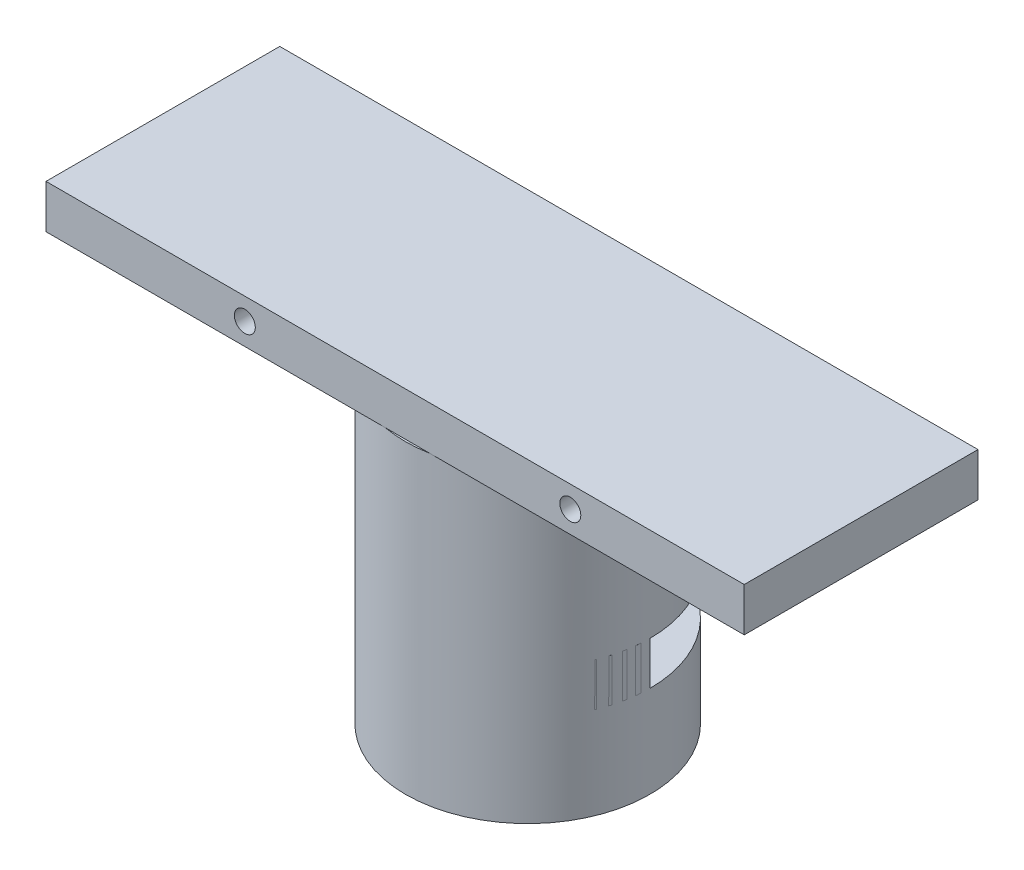
ISO-10303-21;
HEADER;
FILE_DESCRIPTION(('STEP AP214'),'2;1');
FILE_NAME('part.step','',(''),(''),'','','');
FILE_SCHEMA(('AUTOMOTIVE_DESIGN { 1 0 10303 214 1 1 1 1 }'));
ENDSEC;
DATA;
#1=APPLICATION_CONTEXT('core data for automotive mechanical design processes');
#2=APPLICATION_PROTOCOL_DEFINITION('international standard','automotive_design',2000,#1);
#3=PRODUCT_CONTEXT('',#1,'mechanical');
#4=PRODUCT('Part','Part','',(#3));
#5=PRODUCT_RELATED_PRODUCT_CATEGORY('part','',(#4));
#6=PRODUCT_DEFINITION_FORMATION('','',#4);
#7=PRODUCT_DEFINITION_CONTEXT('part definition',#1,'design');
#8=PRODUCT_DEFINITION('design','',#6,#7);
#9=PRODUCT_DEFINITION_SHAPE('','',#8);
#10=(LENGTH_UNIT() NAMED_UNIT(*) SI_UNIT(.MILLI.,.METRE.));
#11=(NAMED_UNIT(*) PLANE_ANGLE_UNIT() SI_UNIT($,.RADIAN.));
#12=(NAMED_UNIT(*) SI_UNIT($,.STERADIAN.) SOLID_ANGLE_UNIT());
#13=UNCERTAINTY_MEASURE_WITH_UNIT(LENGTH_MEASURE(1.E-05),#10,'distance_accuracy_value','');
#14=(GEOMETRIC_REPRESENTATION_CONTEXT(3) GLOBAL_UNCERTAINTY_ASSIGNED_CONTEXT((#13)) GLOBAL_UNIT_ASSIGNED_CONTEXT((#10,
#11,#12)) REPRESENTATION_CONTEXT('',''));
#15=CARTESIAN_POINT('',(0.,0.,0.));
#16=DIRECTION('',(0.,0.,1.));
#17=DIRECTION('',(1.,0.,0.));
#18=AXIS2_PLACEMENT_3D('',#15,#16,#17);
#19=CARTESIAN_POINT('',(0.,19.05,0.));
#20=DIRECTION('',(0.,-1.,0.));
#21=DIRECTION('',(0.,0.,-1.));
#22=AXIS2_PLACEMENT_3D('',#19,#20,#21);
#23=CYLINDRICAL_SURFACE('',#22,6.35);
#24=CARTESIAN_POINT('',(0.,0.,0.));
#25=DIRECTION('',(0.,1.,0.));
#26=DIRECTION('',(0.,0.,1.));
#27=AXIS2_PLACEMENT_3D('',#24,#25,#26);
#28=CIRCLE('',#27,6.35);
#29=CARTESIAN_POINT('',(0.,0.,6.35));
#30=VERTEX_POINT('',#29);
#31=EDGE_CURVE('E181',#30,#30,#28,.T.);
#32=ORIENTED_EDGE('',*,*,#31,.F.);
#33=EDGE_LOOP('',(#32));
#34=FACE_BOUND('',#33,.T.);
#35=CARTESIAN_POINT('',(0.,16.51,0.));
#36=DIRECTION('',(0.,1.,0.));
#37=DIRECTION('',(0.,0.,1.));
#38=AXIS2_PLACEMENT_3D('',#35,#36,#37);
#39=CIRCLE('',#38,6.35);
#40=CARTESIAN_POINT('',(0.,16.51,6.35));
#41=VERTEX_POINT('',#40);
#42=EDGE_CURVE('E173',#41,#41,#39,.T.);
#43=ORIENTED_EDGE('',*,*,#42,.T.);
#44=EDGE_LOOP('',(#43));
#45=FACE_BOUND('',#44,.T.);
#46=DIRECTION('',(0.,-1.,0.));
#47=VECTOR('',#46,1.);
#48=CARTESIAN_POINT('',(3.16694589417082,19.05,-5.50390349691876));
#49=LINE('',#48,#47);
#50=CARTESIAN_POINT('',(3.16694589417082,9.83,-5.50390349691876));
#51=VERTEX_POINT('',#50);
#52=CARTESIAN_POINT('',(3.16694589417082,6.68,-5.50390349691876));
#53=VERTEX_POINT('',#52);
#54=EDGE_CURVE('E193',#51,#53,#49,.T.);
#55=ORIENTED_EDGE('',*,*,#54,.F.);
#56=CARTESIAN_POINT('',(0.,9.83,0.));
#57=DIRECTION('',(0.,-1.,0.));
#58=DIRECTION('',(0.,0.,-1.));
#59=AXIS2_PLACEMENT_3D('',#56,#57,#58);
#60=CIRCLE('',#59,6.35);
#61=CARTESIAN_POINT('',(3.18304730122422,9.83,5.49460734522215));
#62=VERTEX_POINT('',#61);
#63=EDGE_CURVE('E187',#51,#62,#60,.T.);
#64=ORIENTED_EDGE('',*,*,#63,.T.);
#65=DIRECTION('',(0.,-1.,0.));
#66=VECTOR('',#65,1.);
#67=CARTESIAN_POINT('',(3.18304730122422,19.05,5.49460734522215));
#68=LINE('',#67,#66);
#69=CARTESIAN_POINT('',(3.18304730122422,6.68,5.49460734522215));
#70=VERTEX_POINT('',#69);
#71=EDGE_CURVE('E176',#62,#70,#68,.T.);
#72=ORIENTED_EDGE('',*,*,#71,.T.);
#73=CARTESIAN_POINT('',(0.,6.68,0.));
#74=DIRECTION('',(0.,1.,0.));
#75=DIRECTION('',(0.,0.,1.));
#76=AXIS2_PLACEMENT_3D('',#73,#74,#75);
#77=CIRCLE('',#76,6.35);
#78=EDGE_CURVE('E190',#70,#53,#77,.T.);
#79=ORIENTED_EDGE('',*,*,#78,.T.);
#80=EDGE_LOOP('',(#55,#64,#72,#79));
#81=FACE_BOUND('',#80,.T.);
#82=CARTESIAN_POINT('',(0.,6.68,0.));
#83=DIRECTION('',(0.,-1.,0.));
#84=DIRECTION('',(0.,0.,-1.));
#85=AXIS2_PLACEMENT_3D('',#82,#83,#84);
#86=CIRCLE('',#85,6.35);
#87=CARTESIAN_POINT('',(-3.18304730122422,6.68,5.49460734522215));
#88=VERTEX_POINT('',#87);
#89=CARTESIAN_POINT('',(-3.16694589417082,6.68,-5.50390349691876));
#90=VERTEX_POINT('',#89);
#91=EDGE_CURVE('E199',#88,#90,#86,.T.);
#92=ORIENTED_EDGE('',*,*,#91,.F.);
#93=DIRECTION('',(0.,-1.,0.));
#94=VECTOR('',#93,1.);
#95=CARTESIAN_POINT('',(-3.18304730122422,19.05,5.49460734522215));
#96=LINE('',#95,#94);
#97=CARTESIAN_POINT('',(-3.18304730122422,9.83,5.49460734522215));
#98=VERTEX_POINT('',#97);
#99=EDGE_CURVE('E42',#88,#98,#96,.F.);
#100=ORIENTED_EDGE('',*,*,#99,.T.);
#101=CARTESIAN_POINT('',(0.,9.83,0.));
#102=DIRECTION('',(0.,1.,0.));
#103=DIRECTION('',(0.,0.,1.));
#104=AXIS2_PLACEMENT_3D('',#101,#102,#103);
#105=CIRCLE('',#104,6.35);
#106=CARTESIAN_POINT('',(-3.16694589417082,9.83,-5.50390349691876));
#107=VERTEX_POINT('',#106);
#108=EDGE_CURVE('E201',#107,#98,#105,.T.);
#109=ORIENTED_EDGE('',*,*,#108,.F.);
#110=DIRECTION('',(0.,-1.,0.));
#111=VECTOR('',#110,1.);
#112=CARTESIAN_POINT('',(-3.16694589417082,19.05,-5.50390349691876));
#113=LINE('',#112,#111);
#114=EDGE_CURVE('E197',#90,#107,#113,.F.);
#115=ORIENTED_EDGE('',*,*,#114,.F.);
#116=EDGE_LOOP('',(#92,#100,#109,#115));
#117=FACE_BOUND('',#116,.T.);
#118=ADVANCED_FACE('F33',(#34,#45,#81,#117),#23,.F.);
#119=CARTESIAN_POINT('',(0.,19.05,0.));
#120=DIRECTION('',(0.,-1.,0.));
#121=DIRECTION('',(0.,0.,-1.));
#122=AXIS2_PLACEMENT_3D('',#119,#120,#121);
#123=CYLINDRICAL_SURFACE('',#122,8.89);
#124=CARTESIAN_POINT('',(0.,9.83,0.));
#125=DIRECTION('',(0.,1.,0.));
#126=DIRECTION('',(0.,0.,1.));
#127=AXIS2_PLACEMENT_3D('',#124,#125,#126);
#128=CIRCLE('',#127,8.89);
#129=CARTESIAN_POINT('',(-4.43694686625787,9.83,-7.70360970623541));
#130=VERTEX_POINT('',#129);
#131=CARTESIAN_POINT('',(-8.88999513956918,9.83,-0.00929615169578552));
#132=VERTEX_POINT('',#131);
#133=EDGE_CURVE('E241',#130,#132,#128,.T.);
#134=ORIENTED_EDGE('',*,*,#133,.T.);
#135=DIRECTION('',(0.,-1.,0.));
#136=VECTOR('',#135,1.);
#137=CARTESIAN_POINT('',(-8.88999513956918,8.255,-0.00929615169578436));
#138=LINE('',#137,#136);
#139=CARTESIAN_POINT('',(-8.88999513956918,6.68,-0.00929615169578552));
#140=VERTEX_POINT('',#139);
#141=EDGE_CURVE('E11',#132,#140,#138,.T.);
#142=ORIENTED_EDGE('',*,*,#141,.T.);
#143=CARTESIAN_POINT('',(0.,6.68,0.));
#144=DIRECTION('',(0.,-1.,0.));
#145=DIRECTION('',(0.,0.,-1.));
#146=AXIS2_PLACEMENT_3D('',#143,#144,#145);
#147=CIRCLE('',#146,8.89);
#148=CARTESIAN_POINT('',(-4.43694686625787,6.68,-7.70360970623541));
#149=VERTEX_POINT('',#148);
#150=EDGE_CURVE('E238',#140,#149,#147,.T.);
#151=ORIENTED_EDGE('',*,*,#150,.T.);
#152=DIRECTION('',(0.,-1.,0.));
#153=VECTOR('',#152,1.);
#154=CARTESIAN_POINT('',(-4.43694686625787,19.05,-7.70360970623541));
#155=LINE('',#154,#153);
#156=EDGE_CURVE('E235',#149,#130,#155,.F.);
#157=ORIENTED_EDGE('',*,*,#156,.T.);
#158=EDGE_LOOP('',(#134,#142,#151,#157));
#159=FACE_BOUND('',#158,.T.);
#160=CARTESIAN_POINT('',(0.,22.225,0.));
#161=DIRECTION('',(0.,1.,0.));
#162=DIRECTION('',(0.,0.,1.));
#163=AXIS2_PLACEMENT_3D('',#160,#161,#162);
#164=CIRCLE('',#163,8.89);
#165=CARTESIAN_POINT('',(-3.27208521289288,22.225,-8.26592755591093));
#166=VERTEX_POINT('',#165);
#167=CARTESIAN_POINT('',(-1.6252333486519,22.225,8.74017829122666));
#168=VERTEX_POINT('',#167);
#169=EDGE_CURVE('E168',#166,#168,#164,.T.);
#170=ORIENTED_EDGE('',*,*,#169,.F.);
#171=DIRECTION('',(0.,1.,0.));
#172=VECTOR('',#171,1.);
#173=CARTESIAN_POINT('',(-3.27208521289288,0.,-8.26592755591093));
#174=LINE('',#173,#172);
#175=CARTESIAN_POINT('',(-3.27208521289288,0.,-8.26592755591093));
#176=VERTEX_POINT('',#175);
#177=EDGE_CURVE('E156',#176,#166,#174,.T.);
#178=ORIENTED_EDGE('',*,*,#177,.F.);
#179=CARTESIAN_POINT('',(0.,0.,0.));
#180=DIRECTION('',(0.,1.,0.));
#181=DIRECTION('',(0.,0.,1.));
#182=AXIS2_PLACEMENT_3D('',#179,#180,#181);
#183=CIRCLE('',#182,8.89);
#184=CARTESIAN_POINT('',(3.27208521289288,0.,-8.26592755591093));
#185=VERTEX_POINT('',#184);
#186=EDGE_CURVE('E165',#176,#185,#183,.T.);
#187=ORIENTED_EDGE('',*,*,#186,.T.);
#188=DIRECTION('',(0.,1.,0.));
#189=VECTOR('',#188,1.);
#190=CARTESIAN_POINT('',(3.27208521289288,0.,-8.26592755591093));
#191=LINE('',#190,#189);
#192=CARTESIAN_POINT('',(3.27208521289288,22.225,-8.26592755591093));
#193=VERTEX_POINT('',#192);
#194=EDGE_CURVE('E158',#185,#193,#191,.T.);
#195=ORIENTED_EDGE('',*,*,#194,.T.);
#196=CARTESIAN_POINT('',(1.6252333486519,22.225,8.74017829122666));
#197=VERTEX_POINT('',#196);
#198=EDGE_CURVE('E301',#197,#193,#164,.T.);
#199=ORIENTED_EDGE('',*,*,#198,.F.);
#200=EDGE_CURVE('E300',#168,#197,#164,.T.);
#201=ORIENTED_EDGE('',*,*,#200,.F.);
#202=EDGE_LOOP('',(#170,#178,#187,#195,#199,#201));
#203=FACE_BOUND('',#202,.T.);
#204=DIRECTION('',(0.,-1.,0.));
#205=VECTOR('',#204,1.);
#206=CARTESIAN_POINT('',(8.88999513956918,8.255,-0.00929615169661382));
#207=LINE('',#206,#205);
#208=CARTESIAN_POINT('',(8.88999513956917,9.83,-0.00929615169661382));
#209=VERTEX_POINT('',#208);
#210=CARTESIAN_POINT('',(8.88999513956918,6.68,-0.00929615169578435));
#211=VERTEX_POINT('',#210);
#212=EDGE_CURVE('E195',#209,#211,#207,.T.);
#213=ORIENTED_EDGE('',*,*,#212,.F.);
#214=CARTESIAN_POINT('',(0.,9.83,0.));
#215=DIRECTION('',(0.,-1.,0.));
#216=DIRECTION('',(0.,0.,-1.));
#217=AXIS2_PLACEMENT_3D('',#214,#215,#216);
#218=CIRCLE('',#217,8.89);
#219=CARTESIAN_POINT('',(4.43694686625787,9.83,-7.70360970623541));
#220=VERTEX_POINT('',#219);
#221=EDGE_CURVE('E265',#220,#209,#218,.T.);
#222=ORIENTED_EDGE('',*,*,#221,.F.);
#223=DIRECTION('',(0.,-1.,0.));
#224=VECTOR('',#223,1.);
#225=CARTESIAN_POINT('',(4.43694686625787,19.05,-7.70360970623541));
#226=LINE('',#225,#224);
#227=CARTESIAN_POINT('',(4.43694686625787,6.68,-7.70360970623541));
#228=VERTEX_POINT('',#227);
#229=EDGE_CURVE('E262',#220,#228,#226,.T.);
#230=ORIENTED_EDGE('',*,*,#229,.T.);
#231=CARTESIAN_POINT('',(0.,6.68,0.));
#232=DIRECTION('',(0.,1.,0.));
#233=DIRECTION('',(0.,0.,1.));
#234=AXIS2_PLACEMENT_3D('',#231,#232,#233);
#235=CIRCLE('',#234,8.89);
#236=EDGE_CURVE('E267',#211,#228,#235,.T.);
#237=ORIENTED_EDGE('',*,*,#236,.F.);
#238=EDGE_LOOP('',(#213,#222,#230,#237));
#239=FACE_BOUND('',#238,.T.);
#240=ADVANCED_FACE('F35',(#159,#203,#239),#123,.T.);
#241=CARTESIAN_POINT('',(0.,22.225,0.));
#242=DIRECTION('',(0.,1.,0.));
#243=DIRECTION('',(0.,0.,1.));
#244=AXIS2_PLACEMENT_3D('',#241,#242,#243);
#245=PLANE('',#244);
#246=DIRECTION('',(1.,0.,0.));
#247=VECTOR('',#246,1.);
#248=CARTESIAN_POINT('',(24.4951533703859,22.225,8.74017829122666));
#249=LINE('',#248,#247);
#250=EDGE_CURVE('E172',#168,#197,#249,.T.);
#251=ORIENTED_EDGE('',*,*,#250,.F.);
#252=ORIENTED_EDGE('',*,*,#200,.T.);
#253=EDGE_LOOP('',(#251,#252));
#254=FACE_BOUND('',#253,.T.);
#255=ADVANCED_FACE('F308',(#254),#245,.T.);
#256=CARTESIAN_POINT('',(0.,0.,0.));
#257=DIRECTION('',(0.,1.,0.));
#258=DIRECTION('',(0.,0.,1.));
#259=AXIS2_PLACEMENT_3D('',#256,#257,#258);
#260=PLANE('',#259);
#261=ORIENTED_EDGE('',*,*,#31,.T.);
#262=EDGE_LOOP('',(#261));
#263=FACE_BOUND('',#262,.T.);
#264=ORIENTED_EDGE('',*,*,#186,.F.);
#265=DIRECTION('',(1.,0.,0.));
#266=VECTOR('',#265,1.);
#267=CARTESIAN_POINT('',(-3.27208521289288,0.,-8.26592755591093));
#268=LINE('',#267,#266);
#269=EDGE_CURVE('E152',#176,#185,#268,.T.);
#270=ORIENTED_EDGE('',*,*,#269,.T.);
#271=EDGE_LOOP('',(#264,#270));
#272=FACE_BOUND('',#271,.T.);
#273=ADVANCED_FACE('F171',(#263,#272),#260,.F.);
#274=CARTESIAN_POINT('',(0.,16.51,0.));
#275=DIRECTION('',(0.,1.,0.));
#276=DIRECTION('',(0.,0.,1.));
#277=AXIS2_PLACEMENT_3D('',#274,#275,#276);
#278=PLANE('',#277);
#279=ORIENTED_EDGE('',*,*,#42,.F.);
#280=EDGE_LOOP('',(#279));
#281=FACE_BOUND('',#280,.T.);
#282=ADVANCED_FACE('F337',(#281),#278,.F.);
#283=CARTESIAN_POINT('',(0.,22.225,0.));
#284=DIRECTION('',(0.,-1.,0.));
#285=DIRECTION('',(0.,0.,-1.));
#286=AXIS2_PLACEMENT_3D('',#283,#284,#285);
#287=PLANE('',#286);
#288=CARTESIAN_POINT('',(24.4951533703859,22.225,8.74017829122666));
#289=VERTEX_POINT('',#288);
#290=EDGE_CURVE('E179',#197,#289,#249,.T.);
#291=ORIENTED_EDGE('',*,*,#290,.F.);
#292=ORIENTED_EDGE('',*,*,#198,.T.);
#293=DIRECTION('',(-1.,0.,0.));
#294=VECTOR('',#293,1.);
#295=CARTESIAN_POINT('',(-26.3048466296141,22.225,-8.26592755591093));
#296=LINE('',#295,#294);
#297=CARTESIAN_POINT('',(24.4951533703859,22.225,-8.26592755591093));
#298=VERTEX_POINT('',#297);
#299=EDGE_CURVE('E284',#298,#193,#296,.T.);
#300=ORIENTED_EDGE('',*,*,#299,.F.);
#301=DIRECTION('',(0.,0.,-1.));
#302=VECTOR('',#301,1.);
#303=CARTESIAN_POINT('',(24.4951533703859,22.225,-8.26592755591093));
#304=LINE('',#303,#302);
#305=EDGE_CURVE('E270',#289,#298,#304,.T.);
#306=ORIENTED_EDGE('',*,*,#305,.F.);
#307=EDGE_LOOP('',(#291,#292,#300,#306));
#308=FACE_BOUND('',#307,.T.);
#309=ADVANCED_FACE('F310',(#308),#287,.T.);
#310=CARTESIAN_POINT('',(24.4951533703859,25.4,-8.26592755591093));
#311=DIRECTION('',(-1.,0.,0.));
#312=DIRECTION('',(0.,0.,1.));
#313=AXIS2_PLACEMENT_3D('',#310,#311,#312);
#314=PLANE('',#313);
#315=ORIENTED_EDGE('',*,*,#305,.T.);
#316=DIRECTION('',(0.,-1.,0.));
#317=VECTOR('',#316,1.);
#318=CARTESIAN_POINT('',(24.4951533703859,25.4,-8.26592755591093));
#319=LINE('',#318,#317);
#320=CARTESIAN_POINT('',(24.4951533703859,25.4,-8.26592755591093));
#321=VERTEX_POINT('',#320);
#322=EDGE_CURVE('E297',#321,#298,#319,.T.);
#323=ORIENTED_EDGE('',*,*,#322,.F.);
#324=DIRECTION('',(0.,0.,-1.));
#325=VECTOR('',#324,1.);
#326=CARTESIAN_POINT('',(24.4951533703859,25.4,-8.26592755591093));
#327=LINE('',#326,#325);
#328=CARTESIAN_POINT('',(24.4951533703859,25.4,8.74017829122666));
#329=VERTEX_POINT('',#328);
#330=EDGE_CURVE('E271',#329,#321,#327,.T.);
#331=ORIENTED_EDGE('',*,*,#330,.F.);
#332=DIRECTION('',(0.,-1.,0.));
#333=VECTOR('',#332,1.);
#334=CARTESIAN_POINT('',(24.4951533703859,25.4,8.74017829122666));
#335=LINE('',#334,#333);
#336=EDGE_CURVE('E280',#329,#289,#335,.T.);
#337=ORIENTED_EDGE('',*,*,#336,.T.);
#338=EDGE_LOOP('',(#315,#323,#331,#337));
#339=FACE_BOUND('',#338,.T.);
#340=ADVANCED_FACE('F329',(#339),#314,.F.);
#341=CARTESIAN_POINT('',(-26.3048466296141,25.4,-8.26592755591093));
#342=DIRECTION('',(0.,0.,1.));
#343=DIRECTION('',(1.,0.,0.));
#344=AXIS2_PLACEMENT_3D('',#341,#342,#343);
#345=PLANE('',#344);
#346=CARTESIAN_POINT('',(11.8399237727617,23.8125,-8.26592755591093));
#347=DIRECTION('',(0.,0.,1.));
#348=DIRECTION('',(1.,0.,0.));
#349=AXIS2_PLACEMENT_3D('',#346,#347,#348);
#350=CIRCLE('',#349,0.762000000000001);
#351=CARTESIAN_POINT('',(12.6019237727617,23.8125,-8.26592755591093));
#352=VERTEX_POINT('',#351);
#353=EDGE_CURVE('E207',#352,#352,#350,.T.);
#354=ORIENTED_EDGE('',*,*,#353,.T.);
#355=EDGE_LOOP('',(#354));
#356=FACE_BOUND('',#355,.T.);
#357=CARTESIAN_POINT('',(-11.8399237727617,23.8125,-8.26592755591093));
#358=DIRECTION('',(0.,0.,1.));
#359=DIRECTION('',(1.,0.,0.));
#360=AXIS2_PLACEMENT_3D('',#357,#358,#359);
#361=CIRCLE('',#360,0.762000000000001);
#362=CARTESIAN_POINT('',(-11.0779237727617,23.8125,-8.26592755591093));
#363=VERTEX_POINT('',#362);
#364=EDGE_CURVE('E206',#363,#363,#361,.T.);
#365=ORIENTED_EDGE('',*,*,#364,.T.);
#366=EDGE_LOOP('',(#365));
#367=FACE_BOUND('',#366,.T.);
#368=ORIENTED_EDGE('',*,*,#299,.T.);
#369=ORIENTED_EDGE('',*,*,#194,.F.);
#370=ORIENTED_EDGE('',*,*,#269,.F.);
#371=ORIENTED_EDGE('',*,*,#177,.T.);
#372=CARTESIAN_POINT('',(-26.3048466296141,22.225,-8.26592755591093));
#373=VERTEX_POINT('',#372);
#374=EDGE_CURVE('E283',#166,#373,#296,.T.);
#375=ORIENTED_EDGE('',*,*,#374,.T.);
#376=DIRECTION('',(0.,-1.,0.));
#377=VECTOR('',#376,1.);
#378=CARTESIAN_POINT('',(-26.3048466296141,25.4,-8.26592755591093));
#379=LINE('',#378,#377);
#380=CARTESIAN_POINT('',(-26.3048466296141,25.4,-8.26592755591093));
#381=VERTEX_POINT('',#380);
#382=EDGE_CURVE('E294',#381,#373,#379,.T.);
#383=ORIENTED_EDGE('',*,*,#382,.F.);
#384=DIRECTION('',(-1.,0.,0.));
#385=VECTOR('',#384,1.);
#386=CARTESIAN_POINT('',(-26.3048466296141,25.4,-8.26592755591093));
#387=LINE('',#386,#385);
#388=EDGE_CURVE('E274',#321,#381,#387,.T.);
#389=ORIENTED_EDGE('',*,*,#388,.F.);
#390=ORIENTED_EDGE('',*,*,#322,.T.);
#391=EDGE_LOOP('',(#368,#369,#370,#371,#375,#383,#389,#390));
#392=FACE_BOUND('',#391,.T.);
#393=ADVANCED_FACE('F155',(#356,#367,#392),#345,.F.);
#394=CARTESIAN_POINT('',(-26.3048466296141,25.4,8.74017829122666));
#395=DIRECTION('',(1.,0.,0.));
#396=DIRECTION('',(0.,0.,-1.));
#397=AXIS2_PLACEMENT_3D('',#394,#395,#396);
#398=PLANE('',#397);
#399=DIRECTION('',(0.,0.,1.));
#400=VECTOR('',#399,1.);
#401=CARTESIAN_POINT('',(-26.3048466296141,22.225,8.74017829122666));
#402=LINE('',#401,#400);
#403=CARTESIAN_POINT('',(-26.3048466296141,22.225,8.74017829122666));
#404=VERTEX_POINT('',#403);
#405=EDGE_CURVE('E286',#373,#404,#402,.T.);
#406=ORIENTED_EDGE('',*,*,#405,.T.);
#407=DIRECTION('',(0.,-1.,0.));
#408=VECTOR('',#407,1.);
#409=CARTESIAN_POINT('',(-26.3048466296141,25.4,8.74017829122666));
#410=LINE('',#409,#408);
#411=CARTESIAN_POINT('',(-26.3048466296141,25.4,8.74017829122666));
#412=VERTEX_POINT('',#411);
#413=EDGE_CURVE('E291',#412,#404,#410,.T.);
#414=ORIENTED_EDGE('',*,*,#413,.F.);
#415=DIRECTION('',(0.,0.,1.));
#416=VECTOR('',#415,1.);
#417=CARTESIAN_POINT('',(-26.3048466296141,25.4,8.74017829122666));
#418=LINE('',#417,#416);
#419=EDGE_CURVE('E276',#381,#412,#418,.T.);
#420=ORIENTED_EDGE('',*,*,#419,.F.);
#421=ORIENTED_EDGE('',*,*,#382,.T.);
#422=EDGE_LOOP('',(#406,#414,#420,#421));
#423=FACE_BOUND('',#422,.T.);
#424=ADVANCED_FACE('F323',(#423),#398,.F.);
#425=CARTESIAN_POINT('',(24.4951533703859,25.4,8.74017829122666));
#426=DIRECTION('',(0.,0.,-1.));
#427=DIRECTION('',(-1.,0.,0.));
#428=AXIS2_PLACEMENT_3D('',#425,#426,#427);
#429=PLANE('',#428);
#430=CARTESIAN_POINT('',(11.8399237727617,23.8125,8.74017829122666));
#431=DIRECTION('',(0.,0.,-1.));
#432=DIRECTION('',(-1.,0.,0.));
#433=AXIS2_PLACEMENT_3D('',#430,#431,#432);
#434=CIRCLE('',#433,0.762000000000001);
#435=CARTESIAN_POINT('',(11.0779237727617,23.8125,8.74017829122666));
#436=VERTEX_POINT('',#435);
#437=EDGE_CURVE('E37',#436,#436,#434,.T.);
#438=ORIENTED_EDGE('',*,*,#437,.T.);
#439=EDGE_LOOP('',(#438));
#440=FACE_BOUND('',#439,.T.);
#441=CARTESIAN_POINT('',(-11.8399237727617,23.8125,8.74017829122666));
#442=DIRECTION('',(0.,0.,-1.));
#443=DIRECTION('',(-1.,0.,0.));
#444=AXIS2_PLACEMENT_3D('',#441,#442,#443);
#445=CIRCLE('',#444,0.762000000000001);
#446=CARTESIAN_POINT('',(-12.6019237727617,23.8125,8.74017829122666));
#447=VERTEX_POINT('',#446);
#448=EDGE_CURVE('E204',#447,#447,#445,.T.);
#449=ORIENTED_EDGE('',*,*,#448,.T.);
#450=EDGE_LOOP('',(#449));
#451=FACE_BOUND('',#450,.T.);
#452=EDGE_CURVE('E178',#404,#168,#249,.T.);
#453=ORIENTED_EDGE('',*,*,#452,.T.);
#454=ORIENTED_EDGE('',*,*,#250,.T.);
#455=ORIENTED_EDGE('',*,*,#290,.T.);
#456=ORIENTED_EDGE('',*,*,#336,.F.);
#457=DIRECTION('',(1.,0.,0.));
#458=VECTOR('',#457,1.);
#459=CARTESIAN_POINT('',(24.4951533703859,25.4,8.74017829122666));
#460=LINE('',#459,#458);
#461=EDGE_CURVE('E278',#412,#329,#460,.T.);
#462=ORIENTED_EDGE('',*,*,#461,.F.);
#463=ORIENTED_EDGE('',*,*,#413,.T.);
#464=EDGE_LOOP('',(#453,#454,#455,#456,#462,#463));
#465=FACE_BOUND('',#464,.T.);
#466=ADVANCED_FACE('F313',(#440,#451,#465),#429,.F.);
#467=CARTESIAN_POINT('',(0.,25.4,0.));
#468=DIRECTION('',(0.,-1.,0.));
#469=DIRECTION('',(0.,0.,-1.));
#470=AXIS2_PLACEMENT_3D('',#467,#468,#469);
#471=PLANE('',#470);
#472=ORIENTED_EDGE('',*,*,#330,.T.);
#473=ORIENTED_EDGE('',*,*,#388,.T.);
#474=ORIENTED_EDGE('',*,*,#419,.T.);
#475=ORIENTED_EDGE('',*,*,#461,.T.);
#476=EDGE_LOOP('',(#472,#473,#474,#475));
#477=FACE_BOUND('',#476,.T.);
#478=ADVANCED_FACE('F325',(#477),#471,.F.);
#479=ORIENTED_EDGE('',*,*,#374,.F.);
#480=ORIENTED_EDGE('',*,*,#169,.T.);
#481=ORIENTED_EDGE('',*,*,#452,.F.);
#482=ORIENTED_EDGE('',*,*,#405,.F.);
#483=EDGE_LOOP('',(#479,#480,#481,#482));
#484=FACE_BOUND('',#483,.T.);
#485=ADVANCED_FACE('F319',(#484),#287,.T.);
#486=CARTESIAN_POINT('',(0.,0.,-0.0185923033932276));
#487=DIRECTION('',(0.,-1.,0.));
#488=DIRECTION('',(0.,0.,-1.));
#489=AXIS2_PLACEMENT_3D('',#486,#487,#488);
#490=CYLINDRICAL_SURFACE('',#489,8.89);
#491=ORIENTED_EDGE('',*,*,#212,.T.);
#492=CARTESIAN_POINT('',(0.,6.68,-0.0185923033932276));
#493=DIRECTION('',(0.,-1.,0.));
#494=DIRECTION('',(0.,0.,-1.));
#495=AXIS2_PLACEMENT_3D('',#492,#493,#494);
#496=CIRCLE('',#495,8.89);
#497=CARTESIAN_POINT('',(4.44499999999998,6.68,7.68037353625044));
#498=VERTEX_POINT('',#497);
#499=EDGE_CURVE('E260',#211,#498,#496,.T.);
#500=ORIENTED_EDGE('',*,*,#499,.T.);
#501=DIRECTION('',(0.,-1.,0.));
#502=VECTOR('',#501,1.);
#503=CARTESIAN_POINT('',(4.44499999999998,9.83,7.68037353625044));
#504=LINE('',#503,#502);
#505=CARTESIAN_POINT('',(4.44499999999998,9.83,7.68037353625044));
#506=VERTEX_POINT('',#505);
#507=EDGE_CURVE('E244',#506,#498,#504,.T.);
#508=ORIENTED_EDGE('',*,*,#507,.F.);
#509=CARTESIAN_POINT('',(0.,9.83,-0.0185923033932276));
#510=DIRECTION('',(0.,-1.,0.));
#511=DIRECTION('',(0.,0.,-1.));
#512=AXIS2_PLACEMENT_3D('',#509,#510,#511);
#513=CIRCLE('',#512,8.89);
#514=EDGE_CURVE('E258',#209,#506,#513,.T.);
#515=ORIENTED_EDGE('',*,*,#514,.F.);
#516=EDGE_LOOP('',(#491,#500,#508,#515));
#517=FACE_BOUND('',#516,.T.);
#518=ADVANCED_FACE('F400',(#517),#490,.F.);
#519=CARTESIAN_POINT('',(4.44499999999998,6.68,-7.7175581430369));
#520=DIRECTION('',(0.,1.,0.));
#521=DIRECTION('',(0.,0.,1.));
#522=AXIS2_PLACEMENT_3D('',#519,#520,#521);
#523=PLANE('',#522);
#524=ORIENTED_EDGE('',*,*,#236,.T.);
#525=DIRECTION('',(-0.499999999999998,0.,0.86602540378444));
#526=VECTOR('',#525,1.);
#527=CARTESIAN_POINT('',(4.44499999999998,6.68,-7.7175581430369));
#528=LINE('',#527,#526);
#529=EDGE_CURVE('E252',#228,#53,#528,.T.);
#530=ORIENTED_EDGE('',*,*,#529,.T.);
#531=ORIENTED_EDGE('',*,*,#78,.F.);
#532=DIRECTION('',(-0.499999999999998,0.,-0.86602540378444));
#533=VECTOR('',#532,1.);
#534=CARTESIAN_POINT('',(4.44499999999998,6.68,7.68037353625044));
#535=LINE('',#534,#533);
#536=EDGE_CURVE('E247',#498,#70,#535,.T.);
#537=ORIENTED_EDGE('',*,*,#536,.F.);
#538=ORIENTED_EDGE('',*,*,#499,.F.);
#539=EDGE_LOOP('',(#524,#530,#531,#537,#538));
#540=FACE_BOUND('',#539,.T.);
#541=ADVANCED_FACE('F413',(#540),#523,.T.);
#542=CARTESIAN_POINT('',(4.44499999999998,9.83,-7.7175581430369));
#543=DIRECTION('',(0.,-1.,0.));
#544=DIRECTION('',(0.,0.,-1.));
#545=AXIS2_PLACEMENT_3D('',#542,#543,#544);
#546=PLANE('',#545);
#547=ORIENTED_EDGE('',*,*,#221,.T.);
#548=ORIENTED_EDGE('',*,*,#514,.T.);
#549=DIRECTION('',(0.499999999999998,0.,0.86602540378444));
#550=VECTOR('',#549,1.);
#551=CARTESIAN_POINT('',(4.44499999999998,9.83,7.68037353625044));
#552=LINE('',#551,#550);
#553=EDGE_CURVE('E249',#62,#506,#552,.T.);
#554=ORIENTED_EDGE('',*,*,#553,.F.);
#555=ORIENTED_EDGE('',*,*,#63,.F.);
#556=DIRECTION('',(0.499999999999998,0.,-0.86602540378444));
#557=VECTOR('',#556,1.);
#558=CARTESIAN_POINT('',(4.44499999999998,9.83,-7.7175581430369));
#559=LINE('',#558,#557);
#560=EDGE_CURVE('E255',#51,#220,#559,.T.);
#561=ORIENTED_EDGE('',*,*,#560,.T.);
#562=EDGE_LOOP('',(#547,#548,#554,#555,#561));
#563=FACE_BOUND('',#562,.T.);
#564=ADVANCED_FACE('F421',(#563),#546,.T.);
#565=CARTESIAN_POINT('',(0.,0.,-0.0185923033932276));
#566=DIRECTION('',(-0.86602540378444,0.,-0.499999999999998));
#567=DIRECTION('',(-0.499999999999998,0.,0.86602540378444));
#568=AXIS2_PLACEMENT_3D('',#565,#566,#567);
#569=PLANE('',#568);
#570=ORIENTED_EDGE('',*,*,#560,.F.);
#571=ORIENTED_EDGE('',*,*,#54,.T.);
#572=ORIENTED_EDGE('',*,*,#529,.F.);
#573=ORIENTED_EDGE('',*,*,#229,.F.);
#574=EDGE_LOOP('',(#570,#571,#572,#573));
#575=FACE_BOUND('',#574,.T.);
#576=ADVANCED_FACE('F429',(#575),#569,.F.);
#577=CARTESIAN_POINT('',(0.,0.,-0.0185923033932276));
#578=DIRECTION('',(0.86602540378444,0.,-0.499999999999998));
#579=DIRECTION('',(-0.499999999999998,0.,-0.86602540378444));
#580=AXIS2_PLACEMENT_3D('',#577,#578,#579);
#581=PLANE('',#580);
#582=ORIENTED_EDGE('',*,*,#553,.T.);
#583=ORIENTED_EDGE('',*,*,#507,.T.);
#584=ORIENTED_EDGE('',*,*,#536,.T.);
#585=ORIENTED_EDGE('',*,*,#71,.F.);
#586=EDGE_LOOP('',(#582,#583,#584,#585));
#587=FACE_BOUND('',#586,.T.);
#588=ADVANCED_FACE('F437',(#587),#581,.T.);
#589=CARTESIAN_POINT('',(0.,0.,-0.0185923033932276));
#590=DIRECTION('',(0.,-1.,0.));
#591=DIRECTION('',(0.,0.,-1.));
#592=AXIS2_PLACEMENT_3D('',#589,#590,#591);
#593=CYLINDRICAL_SURFACE('',#592,8.89);
#594=CARTESIAN_POINT('',(0.,9.83,-0.0185923033932276));
#595=DIRECTION('',(0.,-1.,0.));
#596=DIRECTION('',(0.,0.,-1.));
#597=AXIS2_PLACEMENT_3D('',#594,#595,#596);
#598=CIRCLE('',#597,8.89);
#599=CARTESIAN_POINT('',(-4.44499999999998,9.83,7.68037353625044));
#600=VERTEX_POINT('',#599);
#601=EDGE_CURVE('E229',#600,#132,#598,.T.);
#602=ORIENTED_EDGE('',*,*,#601,.F.);
#603=DIRECTION('',(0.,1.,0.));
#604=VECTOR('',#603,1.);
#605=CARTESIAN_POINT('',(-4.44499999999998,9.83,7.68037353625044));
#606=LINE('',#605,#604);
#607=CARTESIAN_POINT('',(-4.44499999999998,6.68,7.68037353625044));
#608=VERTEX_POINT('',#607);
#609=EDGE_CURVE('E226',#608,#600,#606,.T.);
#610=ORIENTED_EDGE('',*,*,#609,.F.);
#611=CARTESIAN_POINT('',(0.,6.68,-0.0185923033932276));
#612=DIRECTION('',(0.,-1.,0.));
#613=DIRECTION('',(0.,0.,-1.));
#614=AXIS2_PLACEMENT_3D('',#611,#612,#613);
#615=CIRCLE('',#614,8.89);
#616=EDGE_CURVE('E232',#608,#140,#615,.T.);
#617=ORIENTED_EDGE('',*,*,#616,.T.);
#618=ORIENTED_EDGE('',*,*,#141,.F.);
#619=EDGE_LOOP('',(#602,#610,#617,#618));
#620=FACE_BOUND('',#619,.T.);
#621=ADVANCED_FACE('F445',(#620),#593,.F.);
#622=CARTESIAN_POINT('',(-4.44499999999998,9.83,7.68037353625044));
#623=DIRECTION('',(0.,1.,0.));
#624=DIRECTION('',(0.,0.,1.));
#625=AXIS2_PLACEMENT_3D('',#622,#623,#624);
#626=PLANE('',#625);
#627=DIRECTION('',(0.499999999999998,0.,0.86602540378444));
#628=VECTOR('',#627,1.);
#629=CARTESIAN_POINT('',(-4.44499999999998,9.83,-7.7175581430369));
#630=LINE('',#629,#628);
#631=EDGE_CURVE('E50',#130,#107,#630,.T.);
#632=ORIENTED_EDGE('',*,*,#631,.T.);
#633=ORIENTED_EDGE('',*,*,#108,.T.);
#634=DIRECTION('',(0.499999999999998,0.,-0.86602540378444));
#635=VECTOR('',#634,1.);
#636=CARTESIAN_POINT('',(-4.44499999999998,9.83,7.68037353625044));
#637=LINE('',#636,#635);
#638=EDGE_CURVE('E221',#600,#98,#637,.T.);
#639=ORIENTED_EDGE('',*,*,#638,.F.);
#640=ORIENTED_EDGE('',*,*,#601,.T.);
#641=ORIENTED_EDGE('',*,*,#133,.F.);
#642=EDGE_LOOP('',(#632,#633,#639,#640,#641));
#643=FACE_BOUND('',#642,.T.);
#644=ADVANCED_FACE('F453',(#643),#626,.F.);
#645=CARTESIAN_POINT('',(-4.44499999999998,6.68,7.68037353625044));
#646=DIRECTION('',(0.,-1.,0.));
#647=DIRECTION('',(0.,0.,-1.));
#648=AXIS2_PLACEMENT_3D('',#645,#646,#647);
#649=PLANE('',#648);
#650=ORIENTED_EDGE('',*,*,#616,.F.);
#651=DIRECTION('',(-0.499999999999998,0.,0.86602540378444));
#652=VECTOR('',#651,1.);
#653=CARTESIAN_POINT('',(-4.44499999999998,6.68,7.68037353625044));
#654=LINE('',#653,#652);
#655=EDGE_CURVE('E224',#88,#608,#654,.T.);
#656=ORIENTED_EDGE('',*,*,#655,.F.);
#657=ORIENTED_EDGE('',*,*,#91,.T.);
#658=DIRECTION('',(-0.499999999999998,0.,-0.86602540378444));
#659=VECTOR('',#658,1.);
#660=CARTESIAN_POINT('',(-4.44499999999998,6.68,-7.7175581430369));
#661=LINE('',#660,#659);
#662=EDGE_CURVE('E55',#90,#149,#661,.T.);
#663=ORIENTED_EDGE('',*,*,#662,.T.);
#664=ORIENTED_EDGE('',*,*,#150,.F.);
#665=EDGE_LOOP('',(#650,#656,#657,#663,#664));
#666=FACE_BOUND('',#665,.T.);
#667=ADVANCED_FACE('F461',(#666),#649,.F.);
#668=CARTESIAN_POINT('',(0.,0.,-0.0185923033932276));
#669=DIRECTION('',(0.86602540378444,0.,-0.499999999999998));
#670=DIRECTION('',(-0.499999999999998,0.,-0.86602540378444));
#671=AXIS2_PLACEMENT_3D('',#668,#669,#670);
#672=PLANE('',#671);
#673=ORIENTED_EDGE('',*,*,#662,.F.);
#674=ORIENTED_EDGE('',*,*,#114,.T.);
#675=ORIENTED_EDGE('',*,*,#631,.F.);
#676=ORIENTED_EDGE('',*,*,#156,.F.);
#677=EDGE_LOOP('',(#673,#674,#675,#676));
#678=FACE_BOUND('',#677,.T.);
#679=ADVANCED_FACE('F469',(#678),#672,.F.);
#680=CARTESIAN_POINT('',(0.,0.,-0.0185923033932276));
#681=DIRECTION('',(-0.86602540378444,0.,-0.499999999999998));
#682=DIRECTION('',(-0.499999999999998,0.,0.86602540378444));
#683=AXIS2_PLACEMENT_3D('',#680,#681,#682);
#684=PLANE('',#683);
#685=ORIENTED_EDGE('',*,*,#655,.T.);
#686=ORIENTED_EDGE('',*,*,#609,.T.);
#687=ORIENTED_EDGE('',*,*,#638,.T.);
#688=ORIENTED_EDGE('',*,*,#99,.F.);
#689=EDGE_LOOP('',(#685,#686,#687,#688));
#690=FACE_BOUND('',#689,.T.);
#691=ADVANCED_FACE('F477',(#690),#684,.T.);
#692=CARTESIAN_POINT('',(-11.8399237727617,23.8125,8.89));
#693=DIRECTION('',(0.,0.,-1.));
#694=DIRECTION('',(-1.,0.,0.));
#695=AXIS2_PLACEMENT_3D('',#692,#693,#694);
#696=CYLINDRICAL_SURFACE('',#695,0.762000000000001);
#697=ORIENTED_EDGE('',*,*,#448,.F.);
#698=EDGE_LOOP('',(#697));
#699=FACE_BOUND('',#698,.T.);
#700=ORIENTED_EDGE('',*,*,#364,.F.);
#701=EDGE_LOOP('',(#700));
#702=FACE_BOUND('',#701,.T.);
#703=ADVANCED_FACE('F484',(#699,#702),#696,.F.);
#704=CARTESIAN_POINT('',(11.8399237727617,23.8125,8.89));
#705=DIRECTION('',(0.,0.,-1.));
#706=DIRECTION('',(-1.,0.,0.));
#707=AXIS2_PLACEMENT_3D('',#704,#705,#706);
#708=CYLINDRICAL_SURFACE('',#707,0.762000000000001);
#709=ORIENTED_EDGE('',*,*,#437,.F.);
#710=EDGE_LOOP('',(#709));
#711=FACE_BOUND('',#710,.T.);
#712=ORIENTED_EDGE('',*,*,#353,.F.);
#713=EDGE_LOOP('',(#712));
#714=FACE_BOUND('',#713,.T.);
#715=ADVANCED_FACE('F371',(#711,#714),#708,.F.);
#716=CLOSED_SHELL('',(#118,#240,#255,#273,#282,#309,#340,#393,#424,#466,#478,#485,#518,#541,
#564,#576,#588,#621,#644,#667,#679,#691,#703,#715));
#717=MANIFOLD_SOLID_BREP('B2',#716);
#718=ADVANCED_BREP_SHAPE_REPRESENTATION('',(#18,#717),#14);
#719=SHAPE_DEFINITION_REPRESENTATION(#9,#718);
ENDSEC;
END-ISO-10303-21;
